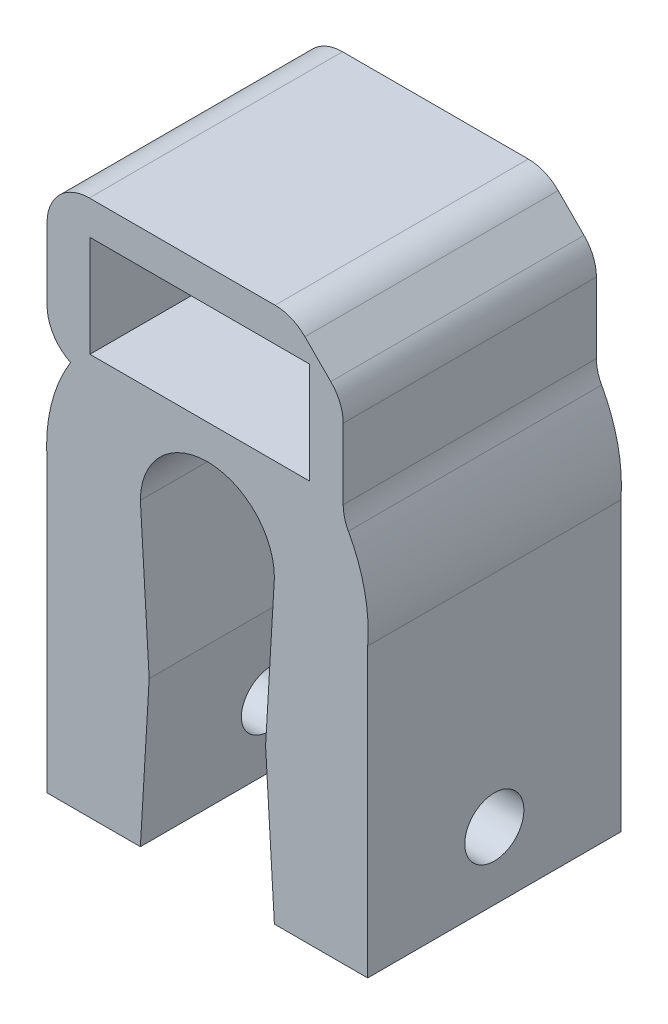
ISO-10303-21;
HEADER;
FILE_DESCRIPTION(('STEP AP214'),'2;1');
FILE_NAME('part.step','',(''),(''),'','','');
FILE_SCHEMA(('AUTOMOTIVE_DESIGN { 1 0 10303 214 1 1 1 1 }'));
ENDSEC;
DATA;
#1=APPLICATION_CONTEXT('core data for automotive mechanical design processes');
#2=APPLICATION_PROTOCOL_DEFINITION('international standard','automotive_design',2000,#1);
#3=PRODUCT_CONTEXT('',#1,'mechanical');
#4=PRODUCT('Part','Part','',(#3));
#5=PRODUCT_RELATED_PRODUCT_CATEGORY('part','',(#4));
#6=PRODUCT_DEFINITION_FORMATION('','',#4);
#7=PRODUCT_DEFINITION_CONTEXT('part definition',#1,'design');
#8=PRODUCT_DEFINITION('design','',#6,#7);
#9=PRODUCT_DEFINITION_SHAPE('','',#8);
#10=(LENGTH_UNIT() NAMED_UNIT(*) SI_UNIT(.MILLI.,.METRE.));
#11=(NAMED_UNIT(*) PLANE_ANGLE_UNIT() SI_UNIT($,.RADIAN.));
#12=(NAMED_UNIT(*) SI_UNIT($,.STERADIAN.) SOLID_ANGLE_UNIT());
#13=UNCERTAINTY_MEASURE_WITH_UNIT(LENGTH_MEASURE(1.E-05),#10,'distance_accuracy_value','');
#14=(GEOMETRIC_REPRESENTATION_CONTEXT(3) GLOBAL_UNCERTAINTY_ASSIGNED_CONTEXT((#13)) GLOBAL_UNIT_ASSIGNED_CONTEXT((#10,
#11,#12)) REPRESENTATION_CONTEXT('',''));
#15=CARTESIAN_POINT('',(0.,0.,0.));
#16=DIRECTION('',(0.,0.,1.));
#17=DIRECTION('',(1.,0.,0.));
#18=AXIS2_PLACEMENT_3D('',#15,#16,#17);
#19=CARTESIAN_POINT('',(0.,0.,85.));
#20=DIRECTION('',(0.,0.,1.));
#21=DIRECTION('',(1.,0.,0.));
#22=AXIS2_PLACEMENT_3D('',#19,#20,#21);
#23=CYLINDRICAL_SURFACE('',#22,9.525);
#24=CARTESIAN_POINT('',(0.,0.,85.));
#25=DIRECTION('',(0.,0.,-1.));
#26=DIRECTION('',(1.,0.,0.));
#27=AXIS2_PLACEMENT_3D('',#24,#25,#26);
#28=CIRCLE('',#27,9.525);
#29=CARTESIAN_POINT('',(8.35184278785506,4.57955751650239,85.));
#30=VERTEX_POINT('',#29);
#31=CARTESIAN_POINT('',(9.49607246292314,-0.741776771618593,85.));
#32=VERTEX_POINT('',#31);
#33=EDGE_CURVE('E281',#30,#32,#28,.T.);
#34=ORIENTED_EDGE('',*,*,#33,.F.);
#35=DIRECTION('',(0.,0.,1.));
#36=VECTOR('',#35,1.);
#37=CARTESIAN_POINT('',(8.35184278785506,4.57955751650239,85.));
#38=LINE('',#37,#36);
#39=CARTESIAN_POINT('',(8.35184278785506,4.57955751650239,100.));
#40=VERTEX_POINT('',#39);
#41=EDGE_CURVE('E386',#30,#40,#38,.T.);
#42=ORIENTED_EDGE('',*,*,#41,.T.);
#43=CARTESIAN_POINT('',(0.,0.,100.));
#44=DIRECTION('',(0.,0.,-1.));
#45=DIRECTION('',(1.,0.,0.));
#46=AXIS2_PLACEMENT_3D('',#43,#44,#45);
#47=CIRCLE('',#46,9.525);
#48=CARTESIAN_POINT('',(9.49607246292314,-0.741776771618593,100.));
#49=VERTEX_POINT('',#48);
#50=EDGE_CURVE('E304',#40,#49,#47,.T.);
#51=ORIENTED_EDGE('',*,*,#50,.T.);
#52=DIRECTION('',(0.,0.,1.));
#53=VECTOR('',#52,1.);
#54=CARTESIAN_POINT('',(9.49607246292314,-0.741776771618593,85.));
#55=LINE('',#54,#53);
#56=EDGE_CURVE('E326',#32,#49,#55,.T.);
#57=ORIENTED_EDGE('',*,*,#56,.F.);
#58=EDGE_LOOP('',(#34,#42,#51,#57));
#59=FACE_BOUND('',#58,.T.);
#60=ADVANCED_FACE('F34',(#59),#23,.T.);
#61=CARTESIAN_POINT('',(0.,0.,85.));
#62=DIRECTION('',(0.,0.,1.));
#63=DIRECTION('',(1.,0.,0.));
#64=AXIS2_PLACEMENT_3D('',#61,#62,#63);
#65=CYLINDRICAL_SURFACE('',#64,3.96875);
#66=CARTESIAN_POINT('',(0.,0.,100.));
#67=DIRECTION('',(0.,0.,1.));
#68=DIRECTION('',(1.,0.,0.));
#69=AXIS2_PLACEMENT_3D('',#66,#67,#68);
#70=CIRCLE('',#69,3.96875);
#71=CARTESIAN_POINT('',(3.96875,0.,100.));
#72=VERTEX_POINT('',#71);
#73=CARTESIAN_POINT('',(-3.96875,0.,100.));
#74=VERTEX_POINT('',#73);
#75=EDGE_CURVE('E268',#72,#74,#70,.T.);
#76=ORIENTED_EDGE('',*,*,#75,.T.);
#77=DIRECTION('',(0.,0.,1.));
#78=VECTOR('',#77,1.);
#79=CARTESIAN_POINT('',(-3.96875,0.,85.));
#80=LINE('',#79,#78);
#81=CARTESIAN_POINT('',(-3.96875,0.,85.));
#82=VERTEX_POINT('',#81);
#83=EDGE_CURVE('E341',#82,#74,#80,.T.);
#84=ORIENTED_EDGE('',*,*,#83,.F.);
#85=CARTESIAN_POINT('',(0.,0.,85.));
#86=DIRECTION('',(0.,0.,1.));
#87=DIRECTION('',(1.,0.,0.));
#88=AXIS2_PLACEMENT_3D('',#85,#86,#87);
#89=CIRCLE('',#88,3.96875);
#90=CARTESIAN_POINT('',(3.96875,0.,85.));
#91=VERTEX_POINT('',#90);
#92=EDGE_CURVE('E269',#91,#82,#89,.T.);
#93=ORIENTED_EDGE('',*,*,#92,.F.);
#94=DIRECTION('',(0.,0.,1.));
#95=VECTOR('',#94,1.);
#96=CARTESIAN_POINT('',(3.96875,0.,85.));
#97=LINE('',#96,#95);
#98=EDGE_CURVE('E293',#91,#72,#97,.T.);
#99=ORIENTED_EDGE('',*,*,#98,.T.);
#100=EDGE_LOOP('',(#76,#84,#93,#99));
#101=FACE_BOUND('',#100,.T.);
#102=ADVANCED_FACE('F425',(#101),#65,.F.);
#103=CARTESIAN_POINT('',(-3.44782568246975,-8.87908345851654,85.));
#104=DIRECTION('',(-0.99828342169628,-0.0585679943857379,0.));
#105=DIRECTION('',(0.0585679943857379,-0.99828342169628,0.));
#106=AXIS2_PLACEMENT_3D('',#103,#104,#105);
#107=PLANE('',#106);
#108=DIRECTION('',(0.0585679943857379,-0.99828342169628,0.));
#109=VECTOR('',#108,1.);
#110=CARTESIAN_POINT('',(-3.44782568246975,-8.87908345851654,100.));
#111=LINE('',#110,#109);
#112=CARTESIAN_POINT('',(-3.44782568246975,-8.87908345851654,100.));
#113=VERTEX_POINT('',#112);
#114=EDGE_CURVE('E296',#74,#113,#111,.T.);
#115=ORIENTED_EDGE('',*,*,#114,.T.);
#116=DIRECTION('',(0.,0.,1.));
#117=VECTOR('',#116,1.);
#118=CARTESIAN_POINT('',(-3.44782568246975,-8.87908345851654,85.));
#119=LINE('',#118,#117);
#120=CARTESIAN_POINT('',(-3.44782568246975,-8.87908345851654,85.));
#121=VERTEX_POINT('',#120);
#122=EDGE_CURVE('E338',#121,#113,#119,.T.);
#123=ORIENTED_EDGE('',*,*,#122,.F.);
#124=DIRECTION('',(0.0585679943857379,-0.99828342169628,0.));
#125=VECTOR('',#124,1.);
#126=CARTESIAN_POINT('',(-3.44782568246975,-8.87908345851654,85.));
#127=LINE('',#126,#125);
#128=EDGE_CURVE('E272',#82,#121,#127,.T.);
#129=ORIENTED_EDGE('',*,*,#128,.F.);
#130=ORIENTED_EDGE('',*,*,#83,.T.);
#131=EDGE_LOOP('',(#115,#123,#129,#130));
#132=FACE_BOUND('',#131,.T.);
#133=ADVANCED_FACE('F428',(#132),#107,.F.);
#134=CARTESIAN_POINT('',(-3.96875,-17.7690834585165,85.));
#135=DIRECTION('',(-0.998287624062382,0.0584963216269505,0.));
#136=DIRECTION('',(-0.0584963216269505,-0.998287624062382,0.));
#137=AXIS2_PLACEMENT_3D('',#134,#135,#136);
#138=PLANE('',#137);
#139=CARTESIAN_POINT('',(-3.73436335544196,-13.7690834585165,92.5));
#140=DIRECTION('',(-0.998287624062382,0.0584963216269505,0.));
#141=DIRECTION('',(-0.0584963216269505,-0.998287624062382,0.));
#142=AXIS2_PLACEMENT_3D('',#139,#140,#141);
#143=ELLIPSE('',#142,1.75300179809766,1.75);
#144=CARTESIAN_POINT('',(-3.8369075124361,-15.5190834585165,92.5));
#145=VERTEX_POINT('',#144);
#146=EDGE_CURVE('E265',#145,#145,#143,.T.);
#147=ORIENTED_EDGE('',*,*,#146,.T.);
#148=EDGE_LOOP('',(#147));
#149=FACE_BOUND('',#148,.T.);
#150=DIRECTION('',(-0.0584963216269505,-0.998287624062382,0.));
#151=VECTOR('',#150,1.);
#152=CARTESIAN_POINT('',(-3.96875,-17.7690834585165,100.));
#153=LINE('',#152,#151);
#154=CARTESIAN_POINT('',(-3.96875,-17.7690834585165,100.));
#155=VERTEX_POINT('',#154);
#156=EDGE_CURVE('E298',#113,#155,#153,.T.);
#157=ORIENTED_EDGE('',*,*,#156,.T.);
#158=DIRECTION('',(0.,0.,1.));
#159=VECTOR('',#158,1.);
#160=CARTESIAN_POINT('',(-3.96875,-17.7690834585165,85.));
#161=LINE('',#160,#159);
#162=CARTESIAN_POINT('',(-3.96875,-17.7690834585165,85.));
#163=VERTEX_POINT('',#162);
#164=EDGE_CURVE('E335',#163,#155,#161,.T.);
#165=ORIENTED_EDGE('',*,*,#164,.F.);
#166=DIRECTION('',(-0.0584963216269505,-0.998287624062382,0.));
#167=VECTOR('',#166,1.);
#168=CARTESIAN_POINT('',(-3.96875,-17.7690834585165,85.));
#169=LINE('',#168,#167);
#170=EDGE_CURVE('E275',#121,#163,#169,.T.);
#171=ORIENTED_EDGE('',*,*,#170,.F.);
#172=ORIENTED_EDGE('',*,*,#122,.T.);
#173=EDGE_LOOP('',(#157,#165,#171,#172));
#174=FACE_BOUND('',#173,.T.);
#175=ADVANCED_FACE('F433',(#149,#174),#138,.F.);
#176=CARTESIAN_POINT('',(-3.96875,-17.7690834585165,85.));
#177=DIRECTION('',(0.,1.,0.));
#178=DIRECTION('',(0.,0.,1.));
#179=AXIS2_PLACEMENT_3D('',#176,#177,#178);
#180=PLANE('',#179);
#181=DIRECTION('',(-1.,0.,0.));
#182=VECTOR('',#181,1.);
#183=CARTESIAN_POINT('',(-3.96875,-17.7690834585165,100.));
#184=LINE('',#183,#182);
#185=CARTESIAN_POINT('',(-9.49607246292314,-17.7690834585165,100.));
#186=VERTEX_POINT('',#185);
#187=EDGE_CURVE('E300',#155,#186,#184,.T.);
#188=ORIENTED_EDGE('',*,*,#187,.T.);
#189=DIRECTION('',(0.,0.,1.));
#190=VECTOR('',#189,1.);
#191=CARTESIAN_POINT('',(-9.49607246292314,-17.7690834585165,85.));
#192=LINE('',#191,#190);
#193=CARTESIAN_POINT('',(-9.49607246292314,-17.7690834585165,85.));
#194=VERTEX_POINT('',#193);
#195=EDGE_CURVE('E332',#194,#186,#192,.T.);
#196=ORIENTED_EDGE('',*,*,#195,.F.);
#197=DIRECTION('',(-1.,0.,0.));
#198=VECTOR('',#197,1.);
#199=CARTESIAN_POINT('',(-3.96875,-17.7690834585165,85.));
#200=LINE('',#199,#198);
#201=EDGE_CURVE('E277',#163,#194,#200,.T.);
#202=ORIENTED_EDGE('',*,*,#201,.F.);
#203=ORIENTED_EDGE('',*,*,#164,.T.);
#204=EDGE_LOOP('',(#188,#196,#202,#203));
#205=FACE_BOUND('',#204,.T.);
#206=ADVANCED_FACE('F439',(#205),#180,.F.);
#207=CARTESIAN_POINT('',(-9.49607246292314,-17.7690834585165,85.));
#208=DIRECTION('',(1.,0.,0.));
#209=DIRECTION('',(0.,1.,0.));
#210=AXIS2_PLACEMENT_3D('',#207,#208,#209);
#211=PLANE('',#210);
#212=CARTESIAN_POINT('',(-9.49607246292314,-13.7690834585165,92.5));
#213=DIRECTION('',(-1.,0.,0.));
#214=DIRECTION('',(0.,-1.,0.));
#215=AXIS2_PLACEMENT_3D('',#212,#213,#214);
#216=CIRCLE('',#215,1.75);
#217=CARTESIAN_POINT('',(-9.49607246292314,-15.5190834585165,92.5));
#218=VERTEX_POINT('',#217);
#219=EDGE_CURVE('E258',#218,#218,#216,.T.);
#220=ORIENTED_EDGE('',*,*,#219,.F.);
#221=EDGE_LOOP('',(#220));
#222=FACE_BOUND('',#221,.T.);
#223=DIRECTION('',(0.,1.,0.));
#224=VECTOR('',#223,1.);
#225=CARTESIAN_POINT('',(-9.49607246292314,-17.7690834585165,100.));
#226=LINE('',#225,#224);
#227=CARTESIAN_POINT('',(-9.49607246292314,-0.741776771618588,100.));
#228=VERTEX_POINT('',#227);
#229=EDGE_CURVE('E302',#186,#228,#226,.T.);
#230=ORIENTED_EDGE('',*,*,#229,.T.);
#231=DIRECTION('',(0.,0.,1.));
#232=VECTOR('',#231,1.);
#233=CARTESIAN_POINT('',(-9.49607246292314,-0.741776771618588,85.));
#234=LINE('',#233,#232);
#235=CARTESIAN_POINT('',(-9.49607246292314,-0.741776771618588,85.));
#236=VERTEX_POINT('',#235);
#237=EDGE_CURVE('E329',#236,#228,#234,.T.);
#238=ORIENTED_EDGE('',*,*,#237,.F.);
#239=DIRECTION('',(0.,1.,0.));
#240=VECTOR('',#239,1.);
#241=CARTESIAN_POINT('',(-9.49607246292314,-17.7690834585165,85.));
#242=LINE('',#241,#240);
#243=EDGE_CURVE('E279',#194,#236,#242,.T.);
#244=ORIENTED_EDGE('',*,*,#243,.F.);
#245=ORIENTED_EDGE('',*,*,#195,.T.);
#246=EDGE_LOOP('',(#230,#238,#244,#245));
#247=FACE_BOUND('',#246,.T.);
#248=ADVANCED_FACE('F443',(#222,#247),#211,.F.);
#249=CARTESIAN_POINT('',(-8.10713426187084,4.999999906,100.));
#250=VERTEX_POINT('',#249);
#251=EDGE_CURVE('E305',#228,#250,#47,.T.);
#252=ORIENTED_EDGE('',*,*,#251,.T.);
#253=DIRECTION('',(0.,0.,1.));
#254=VECTOR('',#253,1.);
#255=CARTESIAN_POINT('',(-8.10713426187084,4.999999906,85.));
#256=LINE('',#255,#254);
#257=CARTESIAN_POINT('',(-8.10713426187084,4.999999906,85.));
#258=VERTEX_POINT('',#257);
#259=EDGE_CURVE('E249',#250,#258,#256,.F.);
#260=ORIENTED_EDGE('',*,*,#259,.T.);
#261=EDGE_CURVE('E282',#236,#258,#28,.T.);
#262=ORIENTED_EDGE('',*,*,#261,.F.);
#263=ORIENTED_EDGE('',*,*,#237,.T.);
#264=EDGE_LOOP('',(#252,#260,#262,#263));
#265=FACE_BOUND('',#264,.T.);
#266=ADVANCED_FACE('F447',(#265),#23,.T.);
#267=CARTESIAN_POINT('',(9.49607246292314,-0.741776771618588,85.));
#268=DIRECTION('',(-1.,0.,0.));
#269=DIRECTION('',(0.,-1.,0.));
#270=AXIS2_PLACEMENT_3D('',#267,#268,#269);
#271=PLANE('',#270);
#272=CARTESIAN_POINT('',(9.49607246292314,-13.7690834585165,92.5));
#273=DIRECTION('',(-1.,0.,0.));
#274=DIRECTION('',(0.,-1.,0.));
#275=AXIS2_PLACEMENT_3D('',#272,#273,#274);
#276=CIRCLE('',#275,1.75);
#277=CARTESIAN_POINT('',(9.49607246292314,-15.5190834585165,92.5));
#278=VERTEX_POINT('',#277);
#279=EDGE_CURVE('E262',#278,#278,#276,.T.);
#280=ORIENTED_EDGE('',*,*,#279,.T.);
#281=EDGE_LOOP('',(#280));
#282=FACE_BOUND('',#281,.T.);
#283=DIRECTION('',(0.,-1.,0.));
#284=VECTOR('',#283,1.);
#285=CARTESIAN_POINT('',(9.49607246292314,-0.741776771618588,100.));
#286=LINE('',#285,#284);
#287=CARTESIAN_POINT('',(9.49607246292314,-17.7690834585165,100.));
#288=VERTEX_POINT('',#287);
#289=EDGE_CURVE('E308',#49,#288,#286,.T.);
#290=ORIENTED_EDGE('',*,*,#289,.T.);
#291=DIRECTION('',(0.,0.,1.));
#292=VECTOR('',#291,1.);
#293=CARTESIAN_POINT('',(9.49607246292314,-17.7690834585165,85.));
#294=LINE('',#293,#292);
#295=CARTESIAN_POINT('',(9.49607246292314,-17.7690834585165,85.));
#296=VERTEX_POINT('',#295);
#297=EDGE_CURVE('E323',#296,#288,#294,.T.);
#298=ORIENTED_EDGE('',*,*,#297,.F.);
#299=DIRECTION('',(0.,-1.,0.));
#300=VECTOR('',#299,1.);
#301=CARTESIAN_POINT('',(9.49607246292314,-0.741776771618588,85.));
#302=LINE('',#301,#300);
#303=EDGE_CURVE('E285',#32,#296,#302,.T.);
#304=ORIENTED_EDGE('',*,*,#303,.F.);
#305=ORIENTED_EDGE('',*,*,#56,.T.);
#306=EDGE_LOOP('',(#290,#298,#304,#305));
#307=FACE_BOUND('',#306,.T.);
#308=ADVANCED_FACE('F405',(#282,#307),#271,.F.);
#309=CARTESIAN_POINT('',(9.49607246292314,-17.7690834585165,85.));
#310=DIRECTION('',(0.,1.,0.));
#311=DIRECTION('',(0.,0.,1.));
#312=AXIS2_PLACEMENT_3D('',#309,#310,#311);
#313=PLANE('',#312);
#314=DIRECTION('',(-1.,0.,0.));
#315=VECTOR('',#314,1.);
#316=CARTESIAN_POINT('',(9.49607246292314,-17.7690834585165,100.));
#317=LINE('',#316,#315);
#318=CARTESIAN_POINT('',(3.96875,-17.7690834585165,100.));
#319=VERTEX_POINT('',#318);
#320=EDGE_CURVE('E310',#288,#319,#317,.T.);
#321=ORIENTED_EDGE('',*,*,#320,.T.);
#322=DIRECTION('',(0.,0.,1.));
#323=VECTOR('',#322,1.);
#324=CARTESIAN_POINT('',(3.96875,-17.7690834585165,85.));
#325=LINE('',#324,#323);
#326=CARTESIAN_POINT('',(3.96875,-17.7690834585165,85.));
#327=VERTEX_POINT('',#326);
#328=EDGE_CURVE('E320',#327,#319,#325,.T.);
#329=ORIENTED_EDGE('',*,*,#328,.F.);
#330=DIRECTION('',(-1.,0.,0.));
#331=VECTOR('',#330,1.);
#332=CARTESIAN_POINT('',(9.49607246292314,-17.7690834585165,85.));
#333=LINE('',#332,#331);
#334=EDGE_CURVE('E287',#296,#327,#333,.T.);
#335=ORIENTED_EDGE('',*,*,#334,.F.);
#336=ORIENTED_EDGE('',*,*,#297,.T.);
#337=EDGE_LOOP('',(#321,#329,#335,#336));
#338=FACE_BOUND('',#337,.T.);
#339=ADVANCED_FACE('F411',(#338),#313,.F.);
#340=CARTESIAN_POINT('',(3.96875,-17.7690834585165,85.));
#341=DIRECTION('',(0.998287624062382,0.0584963216269505,0.));
#342=DIRECTION('',(-0.0584963216269505,0.998287624062382,0.));
#343=AXIS2_PLACEMENT_3D('',#340,#341,#342);
#344=PLANE('',#343);
#345=CARTESIAN_POINT('',(3.73436335544196,-13.7690834585165,92.5));
#346=DIRECTION('',(0.998287624062382,0.0584963216269505,0.));
#347=DIRECTION('',(-0.0584963216269505,0.998287624062382,0.));
#348=AXIS2_PLACEMENT_3D('',#345,#346,#347);
#349=ELLIPSE('',#348,1.75300179809766,1.75);
#350=CARTESIAN_POINT('',(3.63181919844781,-12.0190834585165,92.5));
#351=VERTEX_POINT('',#350);
#352=EDGE_CURVE('E261',#351,#351,#349,.T.);
#353=ORIENTED_EDGE('',*,*,#352,.T.);
#354=EDGE_LOOP('',(#353));
#355=FACE_BOUND('',#354,.T.);
#356=DIRECTION('',(-0.0584963216269505,0.998287624062382,0.));
#357=VECTOR('',#356,1.);
#358=CARTESIAN_POINT('',(3.96875,-17.7690834585165,100.));
#359=LINE('',#358,#357);
#360=CARTESIAN_POINT('',(3.44782568246975,-8.87908345851654,100.));
#361=VERTEX_POINT('',#360);
#362=EDGE_CURVE('E312',#319,#361,#359,.T.);
#363=ORIENTED_EDGE('',*,*,#362,.T.);
#364=DIRECTION('',(0.,0.,1.));
#365=VECTOR('',#364,1.);
#366=CARTESIAN_POINT('',(3.44782568246975,-8.87908345851654,85.));
#367=LINE('',#366,#365);
#368=CARTESIAN_POINT('',(3.44782568246975,-8.87908345851654,85.));
#369=VERTEX_POINT('',#368);
#370=EDGE_CURVE('E317',#369,#361,#367,.T.);
#371=ORIENTED_EDGE('',*,*,#370,.F.);
#372=DIRECTION('',(-0.0584963216269505,0.998287624062382,0.));
#373=VECTOR('',#372,1.);
#374=CARTESIAN_POINT('',(3.96875,-17.7690834585165,85.));
#375=LINE('',#374,#373);
#376=EDGE_CURVE('E289',#327,#369,#375,.T.);
#377=ORIENTED_EDGE('',*,*,#376,.F.);
#378=ORIENTED_EDGE('',*,*,#328,.T.);
#379=EDGE_LOOP('',(#363,#371,#377,#378));
#380=FACE_BOUND('',#379,.T.);
#381=ADVANCED_FACE('F415',(#355,#380),#344,.F.);
#382=CARTESIAN_POINT('',(3.96875,0.,85.));
#383=DIRECTION('',(0.99828342169628,-0.0585679943857379,0.));
#384=DIRECTION('',(0.0585679943857379,0.99828342169628,0.));
#385=AXIS2_PLACEMENT_3D('',#382,#383,#384);
#386=PLANE('',#385);
#387=DIRECTION('',(0.0585679943857379,0.99828342169628,0.));
#388=VECTOR('',#387,1.);
#389=CARTESIAN_POINT('',(3.96875,0.,100.));
#390=LINE('',#389,#388);
#391=EDGE_CURVE('E273',#361,#72,#390,.T.);
#392=ORIENTED_EDGE('',*,*,#391,.T.);
#393=ORIENTED_EDGE('',*,*,#98,.F.);
#394=DIRECTION('',(0.0585679943857379,0.99828342169628,0.));
#395=VECTOR('',#394,1.);
#396=CARTESIAN_POINT('',(3.96875,0.,85.));
#397=LINE('',#396,#395);
#398=EDGE_CURVE('E291',#369,#91,#397,.T.);
#399=ORIENTED_EDGE('',*,*,#398,.F.);
#400=ORIENTED_EDGE('',*,*,#370,.T.);
#401=EDGE_LOOP('',(#392,#393,#399,#400));
#402=FACE_BOUND('',#401,.T.);
#403=ADVANCED_FACE('F420',(#402),#386,.F.);
#404=CARTESIAN_POINT('',(0.,0.,85.));
#405=DIRECTION('',(0.,0.,1.));
#406=DIRECTION('',(1.,0.,0.));
#407=AXIS2_PLACEMENT_3D('',#404,#405,#406);
#408=PLANE('',#407);
#409=DIRECTION('',(0.,-1.,0.));
#410=VECTOR('',#409,1.);
#411=CARTESIAN_POINT('',(6.04392750907686,11.999999876,85.));
#412=LINE('',#411,#410);
#413=CARTESIAN_POINT('',(6.04392750907686,11.999999876,85.));
#414=VERTEX_POINT('',#413);
#415=CARTESIAN_POINT('',(6.04392750907686,5.999999876,85.));
#416=VERTEX_POINT('',#415);
#417=EDGE_CURVE('E229',#414,#416,#412,.T.);
#418=ORIENTED_EDGE('',*,*,#417,.F.);
#419=DIRECTION('',(1.,0.,0.));
#420=VECTOR('',#419,1.);
#421=CARTESIAN_POINT('',(-6.95607249092314,11.999999876,85.));
#422=LINE('',#421,#420);
#423=CARTESIAN_POINT('',(-6.95607249092314,11.999999876,85.));
#424=VERTEX_POINT('',#423);
#425=EDGE_CURVE('E202',#424,#414,#422,.T.);
#426=ORIENTED_EDGE('',*,*,#425,.F.);
#427=DIRECTION('',(0.,1.,0.));
#428=VECTOR('',#427,1.);
#429=CARTESIAN_POINT('',(-6.95607249092314,11.999999876,85.));
#430=LINE('',#429,#428);
#431=CARTESIAN_POINT('',(-6.95607249092314,5.999999876,85.));
#432=VERTEX_POINT('',#431);
#433=EDGE_CURVE('E220',#432,#424,#430,.T.);
#434=ORIENTED_EDGE('',*,*,#433,.F.);
#435=DIRECTION('',(-1.,0.,0.));
#436=VECTOR('',#435,1.);
#437=CARTESIAN_POINT('',(-6.95607249092314,5.999999876,85.));
#438=LINE('',#437,#436);
#439=EDGE_CURVE('E223',#416,#432,#438,.T.);
#440=ORIENTED_EDGE('',*,*,#439,.F.);
#441=EDGE_LOOP('',(#418,#426,#434,#440));
#442=FACE_BOUND('',#441,.T.);
#443=DIRECTION('',(-1.,0.,0.));
#444=VECTOR('',#443,1.);
#445=CARTESIAN_POINT('',(-9.49607246292315,13.999999908,85.));
#446=LINE('',#445,#444);
#447=CARTESIAN_POINT('',(4.00839360314411,13.999999908,85.));
#448=VERTEX_POINT('',#447);
#449=CARTESIAN_POINT('',(-6.99607246292315,13.999999908,85.));
#450=VERTEX_POINT('',#449);
#451=EDGE_CURVE('E246',#448,#450,#446,.T.);
#452=ORIENTED_EDGE('',*,*,#451,.F.);
#453=CARTESIAN_POINT('',(4.00839360314411,11.499999908,85.));
#454=DIRECTION('',(0.,0.,1.));
#455=DIRECTION('',(1.,0.,0.));
#456=AXIS2_PLACEMENT_3D('',#453,#454,#455);
#457=CIRCLE('',#456,2.5);
#458=CARTESIAN_POINT('',(5.77616055611048,13.2677668609664,85.));
#459=VERTEX_POINT('',#458);
#460=EDGE_CURVE('E364',#448,#459,#457,.F.);
#461=ORIENTED_EDGE('',*,*,#460,.T.);
#462=DIRECTION('',(-0.707106781186549,0.707106781186546,0.));
#463=VECTOR('',#462,1.);
#464=CARTESIAN_POINT('',(8.04392750907686,10.999999908,85.));
#465=LINE('',#464,#463);
#466=CARTESIAN_POINT('',(7.31169446204322,11.7322329550336,85.));
#467=VERTEX_POINT('',#466);
#468=EDGE_CURVE('E349',#459,#467,#465,.F.);
#469=ORIENTED_EDGE('',*,*,#468,.T.);
#470=CARTESIAN_POINT('',(5.54392750907686,9.96446600206726,85.));
#471=DIRECTION('',(0.,0.,1.));
#472=DIRECTION('',(1.,0.,0.));
#473=AXIS2_PLACEMENT_3D('',#470,#471,#472);
#474=CIRCLE('',#473,2.5);
#475=CARTESIAN_POINT('',(8.04392750907686,9.96446600206726,85.));
#476=VERTEX_POINT('',#475);
#477=EDGE_CURVE('E362',#467,#476,#474,.F.);
#478=ORIENTED_EDGE('',*,*,#477,.T.);
#479=DIRECTION('',(0.,1.,0.));
#480=VECTOR('',#479,1.);
#481=CARTESIAN_POINT('',(8.04392750907686,4.999999906,85.));
#482=LINE('',#481,#480);
#483=CARTESIAN_POINT('',(8.04392750907686,5.78154111663425,85.));
#484=VERTEX_POINT('',#483);
#485=EDGE_CURVE('E242',#484,#476,#482,.T.);
#486=ORIENTED_EDGE('',*,*,#485,.F.);
#487=CARTESIAN_POINT('',(10.5439275090769,5.78154111663425,85.));
#488=DIRECTION('',(0.,0.,1.));
#489=DIRECTION('',(1.,0.,0.));
#490=AXIS2_PLACEMENT_3D('',#487,#488,#489);
#491=CIRCLE('',#490,2.5);
#492=EDGE_CURVE('E11',#484,#30,#491,.T.);
#493=ORIENTED_EDGE('',*,*,#492,.T.);
#494=ORIENTED_EDGE('',*,*,#33,.T.);
#495=ORIENTED_EDGE('',*,*,#303,.T.);
#496=ORIENTED_EDGE('',*,*,#334,.T.);
#497=ORIENTED_EDGE('',*,*,#376,.T.);
#498=ORIENTED_EDGE('',*,*,#398,.T.);
#499=ORIENTED_EDGE('',*,*,#92,.T.);
#500=ORIENTED_EDGE('',*,*,#128,.T.);
#501=ORIENTED_EDGE('',*,*,#170,.T.);
#502=ORIENTED_EDGE('',*,*,#201,.T.);
#503=ORIENTED_EDGE('',*,*,#243,.T.);
#504=ORIENTED_EDGE('',*,*,#261,.T.);
#505=CARTESIAN_POINT('',(-6.99607246292314,7.23954041220191,85.));
#506=DIRECTION('',(0.,0.,1.));
#507=DIRECTION('',(1.,0.,0.));
#508=AXIS2_PLACEMENT_3D('',#505,#506,#507);
#509=CIRCLE('',#508,2.5);
#510=CARTESIAN_POINT('',(-9.49607246292314,7.23954041220191,85.));
#511=VERTEX_POINT('',#510);
#512=EDGE_CURVE('E358',#258,#511,#509,.F.);
#513=ORIENTED_EDGE('',*,*,#512,.T.);
#514=DIRECTION('',(0.,-1.,0.));
#515=VECTOR('',#514,1.);
#516=CARTESIAN_POINT('',(-9.49607246292314,4.999999906,85.));
#517=LINE('',#516,#515);
#518=CARTESIAN_POINT('',(-9.49607246292315,11.499999908,85.));
#519=VERTEX_POINT('',#518);
#520=EDGE_CURVE('E239',#519,#511,#517,.T.);
#521=ORIENTED_EDGE('',*,*,#520,.F.);
#522=CARTESIAN_POINT('',(-6.99607246292315,11.499999908,85.));
#523=DIRECTION('',(0.,0.,1.));
#524=DIRECTION('',(1.,0.,0.));
#525=AXIS2_PLACEMENT_3D('',#522,#523,#524);
#526=CIRCLE('',#525,2.5);
#527=EDGE_CURVE('E360',#519,#450,#526,.F.);
#528=ORIENTED_EDGE('',*,*,#527,.T.);
#529=EDGE_LOOP('',(#452,#461,#469,#478,#486,#493,#494,#495,#496,#497,#498,#499,#500,#501,#502,
#503,#504,#513,#521,#528));
#530=FACE_BOUND('',#529,.T.);
#531=ADVANCED_FACE('F399',(#442,#530),#408,.F.);
#532=CARTESIAN_POINT('',(0.,0.,100.));
#533=DIRECTION('',(0.,0.,1.));
#534=DIRECTION('',(1.,0.,0.));
#535=AXIS2_PLACEMENT_3D('',#532,#533,#534);
#536=PLANE('',#535);
#537=DIRECTION('',(1.,0.,0.));
#538=VECTOR('',#537,1.);
#539=CARTESIAN_POINT('',(-6.95607249092314,11.999999876,100.));
#540=LINE('',#539,#538);
#541=CARTESIAN_POINT('',(-6.95607249092314,11.999999876,100.));
#542=VERTEX_POINT('',#541);
#543=CARTESIAN_POINT('',(6.04392750907686,11.999999876,100.));
#544=VERTEX_POINT('',#543);
#545=EDGE_CURVE('E199',#542,#544,#540,.T.);
#546=ORIENTED_EDGE('',*,*,#545,.T.);
#547=DIRECTION('',(0.,-1.,0.));
#548=VECTOR('',#547,1.);
#549=CARTESIAN_POINT('',(6.04392750907686,11.999999876,100.));
#550=LINE('',#549,#548);
#551=CARTESIAN_POINT('',(6.04392750907686,5.999999876,100.));
#552=VERTEX_POINT('',#551);
#553=EDGE_CURVE('E211',#544,#552,#550,.T.);
#554=ORIENTED_EDGE('',*,*,#553,.T.);
#555=DIRECTION('',(-1.,0.,0.));
#556=VECTOR('',#555,1.);
#557=CARTESIAN_POINT('',(-6.95607249092314,5.999999876,100.));
#558=LINE('',#557,#556);
#559=CARTESIAN_POINT('',(-6.95607249092314,5.999999876,100.));
#560=VERTEX_POINT('',#559);
#561=EDGE_CURVE('E215',#552,#560,#558,.T.);
#562=ORIENTED_EDGE('',*,*,#561,.T.);
#563=DIRECTION('',(0.,1.,0.));
#564=VECTOR('',#563,1.);
#565=CARTESIAN_POINT('',(-6.95607249092314,11.999999876,100.));
#566=LINE('',#565,#564);
#567=EDGE_CURVE('E207',#560,#542,#566,.T.);
#568=ORIENTED_EDGE('',*,*,#567,.T.);
#569=EDGE_LOOP('',(#546,#554,#562,#568));
#570=FACE_BOUND('',#569,.T.);
#571=DIRECTION('',(0.707106781186549,-0.707106781186546,0.));
#572=VECTOR('',#571,1.);
#573=CARTESIAN_POINT('',(9.52196370853842,9.52196370853844,100.));
#574=LINE('',#573,#572);
#575=CARTESIAN_POINT('',(7.31169446204322,11.7322329550336,100.));
#576=VERTEX_POINT('',#575);
#577=CARTESIAN_POINT('',(5.77616055611048,13.2677668609664,100.));
#578=VERTEX_POINT('',#577);
#579=EDGE_CURVE('E344',#576,#578,#574,.F.);
#580=ORIENTED_EDGE('',*,*,#579,.T.);
#581=CARTESIAN_POINT('',(4.00839360314411,11.499999908,100.));
#582=DIRECTION('',(0.,0.,1.));
#583=DIRECTION('',(1.,0.,0.));
#584=AXIS2_PLACEMENT_3D('',#581,#582,#583);
#585=CIRCLE('',#584,2.5);
#586=CARTESIAN_POINT('',(4.00839360314411,13.999999908,100.));
#587=VERTEX_POINT('',#586);
#588=EDGE_CURVE('E375',#578,#587,#585,.T.);
#589=ORIENTED_EDGE('',*,*,#588,.T.);
#590=DIRECTION('',(-1.,0.,0.));
#591=VECTOR('',#590,1.);
#592=CARTESIAN_POINT('',(-9.49607246292315,13.999999908,100.));
#593=LINE('',#592,#591);
#594=CARTESIAN_POINT('',(-6.99607246292315,13.999999908,100.));
#595=VERTEX_POINT('',#594);
#596=EDGE_CURVE('E243',#587,#595,#593,.T.);
#597=ORIENTED_EDGE('',*,*,#596,.T.);
#598=CARTESIAN_POINT('',(-6.99607246292315,11.499999908,100.));
#599=DIRECTION('',(0.,0.,1.));
#600=DIRECTION('',(1.,0.,0.));
#601=AXIS2_PLACEMENT_3D('',#598,#599,#600);
#602=CIRCLE('',#601,2.5);
#603=CARTESIAN_POINT('',(-9.49607246292315,11.499999908,100.));
#604=VERTEX_POINT('',#603);
#605=EDGE_CURVE('E371',#595,#604,#602,.T.);
#606=ORIENTED_EDGE('',*,*,#605,.T.);
#607=DIRECTION('',(0.,-1.,0.));
#608=VECTOR('',#607,1.);
#609=CARTESIAN_POINT('',(-9.49607246292314,4.999999906,100.));
#610=LINE('',#609,#608);
#611=CARTESIAN_POINT('',(-9.49607246292314,7.23954041220191,100.));
#612=VERTEX_POINT('',#611);
#613=EDGE_CURVE('E235',#604,#612,#610,.T.);
#614=ORIENTED_EDGE('',*,*,#613,.T.);
#615=CARTESIAN_POINT('',(-6.99607246292314,7.23954041220191,100.));
#616=DIRECTION('',(0.,0.,1.));
#617=DIRECTION('',(1.,0.,0.));
#618=AXIS2_PLACEMENT_3D('',#615,#616,#617);
#619=CIRCLE('',#618,2.5);
#620=EDGE_CURVE('E56',#612,#250,#619,.T.);
#621=ORIENTED_EDGE('',*,*,#620,.T.);
#622=ORIENTED_EDGE('',*,*,#251,.F.);
#623=ORIENTED_EDGE('',*,*,#229,.F.);
#624=ORIENTED_EDGE('',*,*,#187,.F.);
#625=ORIENTED_EDGE('',*,*,#156,.F.);
#626=ORIENTED_EDGE('',*,*,#114,.F.);
#627=ORIENTED_EDGE('',*,*,#75,.F.);
#628=ORIENTED_EDGE('',*,*,#391,.F.);
#629=ORIENTED_EDGE('',*,*,#362,.F.);
#630=ORIENTED_EDGE('',*,*,#320,.F.);
#631=ORIENTED_EDGE('',*,*,#289,.F.);
#632=ORIENTED_EDGE('',*,*,#50,.F.);
#633=CARTESIAN_POINT('',(10.5439275090769,5.78154111663425,100.));
#634=DIRECTION('',(0.,0.,1.));
#635=DIRECTION('',(1.,0.,0.));
#636=AXIS2_PLACEMENT_3D('',#633,#634,#635);
#637=CIRCLE('',#636,2.5);
#638=CARTESIAN_POINT('',(8.04392750907686,5.78154111663425,100.));
#639=VERTEX_POINT('',#638);
#640=EDGE_CURVE('E42',#40,#639,#637,.F.);
#641=ORIENTED_EDGE('',*,*,#640,.T.);
#642=DIRECTION('',(0.,1.,0.));
#643=VECTOR('',#642,1.);
#644=CARTESIAN_POINT('',(8.04392750907686,4.999999906,100.));
#645=LINE('',#644,#643);
#646=CARTESIAN_POINT('',(8.04392750907686,9.96446600206726,100.));
#647=VERTEX_POINT('',#646);
#648=EDGE_CURVE('E252',#639,#647,#645,.T.);
#649=ORIENTED_EDGE('',*,*,#648,.T.);
#650=CARTESIAN_POINT('',(5.54392750907686,9.96446600206726,100.));
#651=DIRECTION('',(0.,0.,1.));
#652=DIRECTION('',(1.,0.,0.));
#653=AXIS2_PLACEMENT_3D('',#650,#651,#652);
#654=CIRCLE('',#653,2.5);
#655=EDGE_CURVE('E373',#647,#576,#654,.T.);
#656=ORIENTED_EDGE('',*,*,#655,.T.);
#657=EDGE_LOOP('',(#580,#589,#597,#606,#614,#621,#622,#623,#624,#625,#626,#627,#628,#629,#630,
#631,#632,#641,#649,#656));
#658=FACE_BOUND('',#657,.T.);
#659=ADVANCED_FACE('F217',(#570,#658),#536,.T.);
#660=CARTESIAN_POINT('',(10.3159275370769,-13.7690834585165,92.5));
#661=DIRECTION('',(-1.,0.,0.));
#662=DIRECTION('',(0.,-1.,0.));
#663=AXIS2_PLACEMENT_3D('',#660,#661,#662);
#664=CYLINDRICAL_SURFACE('',#663,1.75);
#665=ORIENTED_EDGE('',*,*,#352,.F.);
#666=EDGE_LOOP('',(#665));
#667=FACE_BOUND('',#666,.T.);
#668=ORIENTED_EDGE('',*,*,#279,.F.);
#669=EDGE_LOOP('',(#668));
#670=FACE_BOUND('',#669,.T.);
#671=ADVANCED_FACE('F533',(#667,#670),#664,.F.);
#672=ORIENTED_EDGE('',*,*,#219,.T.);
#673=EDGE_LOOP('',(#672));
#674=FACE_BOUND('',#673,.T.);
#675=ORIENTED_EDGE('',*,*,#146,.F.);
#676=EDGE_LOOP('',(#675));
#677=FACE_BOUND('',#676,.T.);
#678=ADVANCED_FACE('F528',(#674,#677),#664,.F.);
#679=CARTESIAN_POINT('',(8.04392750907686,4.999999906,85.));
#680=DIRECTION('',(1.,0.,0.));
#681=DIRECTION('',(0.,1.,0.));
#682=AXIS2_PLACEMENT_3D('',#679,#680,#681);
#683=PLANE('',#682);
#684=ORIENTED_EDGE('',*,*,#485,.T.);
#685=DIRECTION('',(0.,0.,-1.));
#686=VECTOR('',#685,1.);
#687=CARTESIAN_POINT('',(8.04392750907686,9.96446600206726,85.));
#688=LINE('',#687,#686);
#689=EDGE_CURVE('E379',#476,#647,#688,.F.);
#690=ORIENTED_EDGE('',*,*,#689,.T.);
#691=ORIENTED_EDGE('',*,*,#648,.F.);
#692=DIRECTION('',(0.,0.,1.));
#693=VECTOR('',#692,1.);
#694=CARTESIAN_POINT('',(8.04392750907686,5.78154111663425,85.));
#695=LINE('',#694,#693);
#696=EDGE_CURVE('E377',#639,#484,#695,.F.);
#697=ORIENTED_EDGE('',*,*,#696,.T.);
#698=EDGE_LOOP('',(#684,#690,#691,#697));
#699=FACE_BOUND('',#698,.T.);
#700=ADVANCED_FACE('F391',(#699),#683,.T.);
#701=CARTESIAN_POINT('',(-9.49607246292314,4.999999906,85.));
#702=DIRECTION('',(-1.,0.,0.));
#703=DIRECTION('',(0.,-1.,0.));
#704=AXIS2_PLACEMENT_3D('',#701,#702,#703);
#705=PLANE('',#704);
#706=ORIENTED_EDGE('',*,*,#613,.F.);
#707=DIRECTION('',(0.,0.,1.));
#708=VECTOR('',#707,1.);
#709=CARTESIAN_POINT('',(-9.49607246292315,11.499999908,85.));
#710=LINE('',#709,#708);
#711=EDGE_CURVE('E384',#604,#519,#710,.F.);
#712=ORIENTED_EDGE('',*,*,#711,.T.);
#713=ORIENTED_EDGE('',*,*,#520,.T.);
#714=DIRECTION('',(0.,0.,-1.));
#715=VECTOR('',#714,1.);
#716=CARTESIAN_POINT('',(-9.49607246292314,7.23954041220191,100.));
#717=LINE('',#716,#715);
#718=EDGE_CURVE('E382',#511,#612,#717,.F.);
#719=ORIENTED_EDGE('',*,*,#718,.T.);
#720=EDGE_LOOP('',(#706,#712,#713,#719));
#721=FACE_BOUND('',#720,.T.);
#722=ADVANCED_FACE('F452',(#721),#705,.T.);
#723=CARTESIAN_POINT('',(-9.49607246292315,13.999999908,85.));
#724=DIRECTION('',(0.,1.,0.));
#725=DIRECTION('',(0.,0.,1.));
#726=AXIS2_PLACEMENT_3D('',#723,#724,#725);
#727=PLANE('',#726);
#728=ORIENTED_EDGE('',*,*,#596,.F.);
#729=DIRECTION('',(0.,0.,1.));
#730=VECTOR('',#729,1.);
#731=CARTESIAN_POINT('',(4.00839360314411,13.999999908,85.));
#732=LINE('',#731,#730);
#733=EDGE_CURVE('E355',#587,#448,#732,.F.);
#734=ORIENTED_EDGE('',*,*,#733,.T.);
#735=ORIENTED_EDGE('',*,*,#451,.T.);
#736=DIRECTION('',(0.,0.,1.));
#737=VECTOR('',#736,1.);
#738=CARTESIAN_POINT('',(-6.99607246292315,13.999999908,85.));
#739=LINE('',#738,#737);
#740=EDGE_CURVE('E352',#450,#595,#739,.T.);
#741=ORIENTED_EDGE('',*,*,#740,.T.);
#742=EDGE_LOOP('',(#728,#734,#735,#741));
#743=FACE_BOUND('',#742,.T.);
#744=ADVANCED_FACE('F460',(#743),#727,.T.);
#745=CARTESIAN_POINT('',(-6.95607249092314,11.999999876,100.));
#746=DIRECTION('',(0.,1.,0.));
#747=DIRECTION('',(-1.,0.,0.));
#748=AXIS2_PLACEMENT_3D('',#745,#746,#747);
#749=PLANE('',#748);
#750=ORIENTED_EDGE('',*,*,#425,.T.);
#751=DIRECTION('',(0.,0.,-1.));
#752=VECTOR('',#751,1.);
#753=CARTESIAN_POINT('',(6.04392750907686,11.999999876,100.));
#754=LINE('',#753,#752);
#755=EDGE_CURVE('E195',#544,#414,#754,.T.);
#756=ORIENTED_EDGE('',*,*,#755,.F.);
#757=ORIENTED_EDGE('',*,*,#545,.F.);
#758=DIRECTION('',(0.,0.,-1.));
#759=VECTOR('',#758,1.);
#760=CARTESIAN_POINT('',(-6.95607249092314,11.999999876,100.));
#761=LINE('',#760,#759);
#762=EDGE_CURVE('E233',#542,#424,#761,.T.);
#763=ORIENTED_EDGE('',*,*,#762,.T.);
#764=EDGE_LOOP('',(#750,#756,#757,#763));
#765=FACE_BOUND('',#764,.T.);
#766=ADVANCED_FACE('F197',(#765),#749,.F.);
#767=CARTESIAN_POINT('',(-6.95607249092314,11.999999876,100.));
#768=DIRECTION('',(-1.,0.,0.));
#769=DIRECTION('',(0.,-1.,0.));
#770=AXIS2_PLACEMENT_3D('',#767,#768,#769);
#771=PLANE('',#770);
#772=ORIENTED_EDGE('',*,*,#433,.T.);
#773=ORIENTED_EDGE('',*,*,#762,.F.);
#774=ORIENTED_EDGE('',*,*,#567,.F.);
#775=DIRECTION('',(0.,0.,-1.));
#776=VECTOR('',#775,1.);
#777=CARTESIAN_POINT('',(-6.95607249092314,5.999999876,100.));
#778=LINE('',#777,#776);
#779=EDGE_CURVE('E236',#560,#432,#778,.T.);
#780=ORIENTED_EDGE('',*,*,#779,.T.);
#781=EDGE_LOOP('',(#772,#773,#774,#780));
#782=FACE_BOUND('',#781,.T.);
#783=ADVANCED_FACE('F517',(#782),#771,.F.);
#784=CARTESIAN_POINT('',(-6.95607249092314,5.999999876,100.));
#785=DIRECTION('',(0.,-1.,0.));
#786=DIRECTION('',(1.,0.,0.));
#787=AXIS2_PLACEMENT_3D('',#784,#785,#786);
#788=PLANE('',#787);
#789=ORIENTED_EDGE('',*,*,#439,.T.);
#790=ORIENTED_EDGE('',*,*,#779,.F.);
#791=ORIENTED_EDGE('',*,*,#561,.F.);
#792=DIRECTION('',(0.,0.,-1.));
#793=VECTOR('',#792,1.);
#794=CARTESIAN_POINT('',(6.04392750907686,5.999999876,100.));
#795=LINE('',#794,#793);
#796=EDGE_CURVE('E206',#552,#416,#795,.T.);
#797=ORIENTED_EDGE('',*,*,#796,.T.);
#798=EDGE_LOOP('',(#789,#790,#791,#797));
#799=FACE_BOUND('',#798,.T.);
#800=ADVANCED_FACE('F512',(#799),#788,.F.);
#801=CARTESIAN_POINT('',(6.04392750907686,11.999999876,100.));
#802=DIRECTION('',(1.,0.,0.));
#803=DIRECTION('',(0.,1.,0.));
#804=AXIS2_PLACEMENT_3D('',#801,#802,#803);
#805=PLANE('',#804);
#806=ORIENTED_EDGE('',*,*,#417,.T.);
#807=ORIENTED_EDGE('',*,*,#796,.F.);
#808=ORIENTED_EDGE('',*,*,#553,.F.);
#809=ORIENTED_EDGE('',*,*,#755,.T.);
#810=EDGE_LOOP('',(#806,#807,#808,#809));
#811=FACE_BOUND('',#810,.T.);
#812=ADVANCED_FACE('F212',(#811),#805,.F.);
#813=CARTESIAN_POINT('',(8.04392750907686,10.999999908,85.));
#814=DIRECTION('',(-0.707106781186546,-0.707106781186549,0.));
#815=DIRECTION('',(0.,0.,1.));
#816=AXIS2_PLACEMENT_3D('',#813,#814,#815);
#817=PLANE('',#816);
#818=ORIENTED_EDGE('',*,*,#468,.F.);
#819=DIRECTION('',(0.,0.,-1.));
#820=VECTOR('',#819,1.);
#821=CARTESIAN_POINT('',(5.77616055611048,13.2677668609664,85.));
#822=LINE('',#821,#820);
#823=EDGE_CURVE('E368',#459,#578,#822,.F.);
#824=ORIENTED_EDGE('',*,*,#823,.T.);
#825=ORIENTED_EDGE('',*,*,#579,.F.);
#826=DIRECTION('',(0.,0.,1.));
#827=VECTOR('',#826,1.);
#828=CARTESIAN_POINT('',(7.31169446204322,11.7322329550336,85.));
#829=LINE('',#828,#827);
#830=EDGE_CURVE('E366',#576,#467,#829,.F.);
#831=ORIENTED_EDGE('',*,*,#830,.T.);
#832=EDGE_LOOP('',(#818,#824,#825,#831));
#833=FACE_BOUND('',#832,.T.);
#834=ADVANCED_FACE('F467',(#833),#817,.F.);
#835=CARTESIAN_POINT('',(4.00839360314411,11.499999908,85.));
#836=DIRECTION('',(0.,0.,1.));
#837=DIRECTION('',(1.,0.,0.));
#838=AXIS2_PLACEMENT_3D('',#835,#836,#837);
#839=CYLINDRICAL_SURFACE('',#838,2.5);
#840=ORIENTED_EDGE('',*,*,#588,.F.);
#841=ORIENTED_EDGE('',*,*,#823,.F.);
#842=ORIENTED_EDGE('',*,*,#460,.F.);
#843=ORIENTED_EDGE('',*,*,#733,.F.);
#844=EDGE_LOOP('',(#840,#841,#842,#843));
#845=FACE_BOUND('',#844,.T.);
#846=ADVANCED_FACE('F471',(#845),#839,.T.);
#847=CARTESIAN_POINT('',(5.54392750907686,9.96446600206726,85.));
#848=DIRECTION('',(0.,0.,-1.));
#849=DIRECTION('',(-1.,0.,0.));
#850=AXIS2_PLACEMENT_3D('',#847,#848,#849);
#851=CYLINDRICAL_SURFACE('',#850,2.5);
#852=ORIENTED_EDGE('',*,*,#477,.F.);
#853=ORIENTED_EDGE('',*,*,#830,.F.);
#854=ORIENTED_EDGE('',*,*,#655,.F.);
#855=ORIENTED_EDGE('',*,*,#689,.F.);
#856=EDGE_LOOP('',(#852,#853,#854,#855));
#857=FACE_BOUND('',#856,.T.);
#858=ADVANCED_FACE('F473',(#857),#851,.T.);
#859=CARTESIAN_POINT('',(-6.99607246292315,11.499999908,85.));
#860=DIRECTION('',(0.,0.,1.));
#861=DIRECTION('',(1.,0.,0.));
#862=AXIS2_PLACEMENT_3D('',#859,#860,#861);
#863=CYLINDRICAL_SURFACE('',#862,2.5);
#864=ORIENTED_EDGE('',*,*,#527,.F.);
#865=ORIENTED_EDGE('',*,*,#711,.F.);
#866=ORIENTED_EDGE('',*,*,#605,.F.);
#867=ORIENTED_EDGE('',*,*,#740,.F.);
#868=EDGE_LOOP('',(#864,#865,#866,#867));
#869=FACE_BOUND('',#868,.T.);
#870=ADVANCED_FACE('F458',(#869),#863,.T.);
#871=CARTESIAN_POINT('',(10.5439275090769,5.78154111663425,85.));
#872=DIRECTION('',(0.,0.,1.));
#873=DIRECTION('',(1.,0.,0.));
#874=AXIS2_PLACEMENT_3D('',#871,#872,#873);
#875=CYLINDRICAL_SURFACE('',#874,2.5);
#876=ORIENTED_EDGE('',*,*,#492,.F.);
#877=ORIENTED_EDGE('',*,*,#696,.F.);
#878=ORIENTED_EDGE('',*,*,#640,.F.);
#879=ORIENTED_EDGE('',*,*,#41,.F.);
#880=EDGE_LOOP('',(#876,#877,#878,#879));
#881=FACE_BOUND('',#880,.T.);
#882=ADVANCED_FACE('F395',(#881),#875,.F.);
#883=CARTESIAN_POINT('',(-6.99607246292314,7.23954041220191,85.));
#884=DIRECTION('',(0.,0.,1.));
#885=DIRECTION('',(1.,0.,0.));
#886=AXIS2_PLACEMENT_3D('',#883,#884,#885);
#887=CYLINDRICAL_SURFACE('',#886,2.5);
#888=ORIENTED_EDGE('',*,*,#512,.F.);
#889=ORIENTED_EDGE('',*,*,#259,.F.);
#890=ORIENTED_EDGE('',*,*,#620,.F.);
#891=ORIENTED_EDGE('',*,*,#718,.F.);
#892=EDGE_LOOP('',(#888,#889,#890,#891));
#893=FACE_BOUND('',#892,.T.);
#894=ADVANCED_FACE('F36',(#893),#887,.T.);
#895=CLOSED_SHELL('',(#60,#102,#133,#175,#206,#248,#266,#308,#339,#381,#403,#531,#659,#671,#678,
#700,#722,#744,#766,#783,#800,#812,#834,#846,#858,#870,#882,#894));
#896=MANIFOLD_SOLID_BREP('B2',#895);
#897=ADVANCED_BREP_SHAPE_REPRESENTATION('',(#18,#896),#14);
#898=SHAPE_DEFINITION_REPRESENTATION(#9,#897);
ENDSEC;
END-ISO-10303-21;
